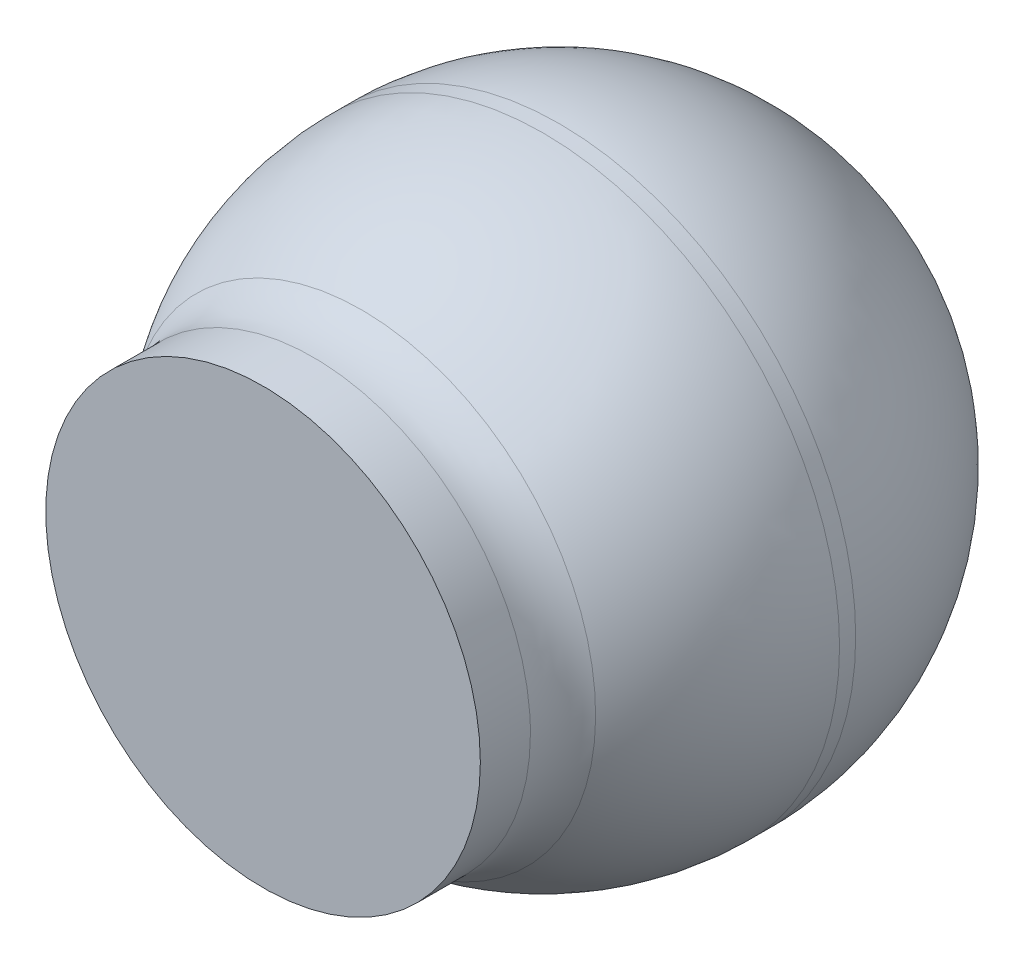
ISO-10303-21;
HEADER;
FILE_DESCRIPTION(('STEP AP214'),'2;1');
FILE_NAME('part.step','',(''),(''),'','','');
FILE_SCHEMA(('AUTOMOTIVE_DESIGN { 1 0 10303 214 1 1 1 1 }'));
ENDSEC;
DATA;
#1=APPLICATION_CONTEXT('core data for automotive mechanical design processes');
#2=APPLICATION_PROTOCOL_DEFINITION('international standard','automotive_design',2000,#1);
#3=PRODUCT_CONTEXT('',#1,'mechanical');
#4=PRODUCT('Part','Part','',(#3));
#5=PRODUCT_RELATED_PRODUCT_CATEGORY('part','',(#4));
#6=PRODUCT_DEFINITION_FORMATION('','',#4);
#7=PRODUCT_DEFINITION_CONTEXT('part definition',#1,'design');
#8=PRODUCT_DEFINITION('design','',#6,#7);
#9=PRODUCT_DEFINITION_SHAPE('','',#8);
#10=(LENGTH_UNIT() NAMED_UNIT(*) SI_UNIT(.MILLI.,.METRE.));
#11=(NAMED_UNIT(*) PLANE_ANGLE_UNIT() SI_UNIT($,.RADIAN.));
#12=(NAMED_UNIT(*) SI_UNIT($,.STERADIAN.) SOLID_ANGLE_UNIT());
#13=UNCERTAINTY_MEASURE_WITH_UNIT(LENGTH_MEASURE(1.E-05),#10,'distance_accuracy_value','');
#14=(GEOMETRIC_REPRESENTATION_CONTEXT(3) GLOBAL_UNCERTAINTY_ASSIGNED_CONTEXT((#13)) GLOBAL_UNIT_ASSIGNED_CONTEXT((#10,
#11,#12)) REPRESENTATION_CONTEXT('',''));
#15=CARTESIAN_POINT('',(0.,0.,0.));
#16=DIRECTION('',(0.,0.,1.));
#17=DIRECTION('',(1.,0.,0.));
#18=AXIS2_PLACEMENT_3D('',#15,#16,#17);
#19=CARTESIAN_POINT('',(-9.452919922269,-9.131349291452,10.006534503384));
#20=DIRECTION('',(0.,0.,-1.));
#21=DIRECTION('',(-1.,0.,0.));
#22=AXIS2_PLACEMENT_3D('',#19,#20,#21);
#23=PLANE('',#22);
#24=CARTESIAN_POINT('',(-9.452919922269,-9.131349291452,10.006534503384));
#25=DIRECTION('',(0.,0.,1.));
#26=DIRECTION('',(1.,0.,0.));
#27=AXIS2_PLACEMENT_3D('',#24,#25,#26);
#28=CIRCLE('',#27,0.275);
#29=CARTESIAN_POINT('',(-9.177919922269,-9.131349291452,10.006534503384));
#30=VERTEX_POINT('',#29);
#31=EDGE_CURVE('E20',#30,#30,#28,.F.);
#32=ORIENTED_EDGE('',*,*,#31,.F.);
#33=EDGE_LOOP('',(#32));
#34=FACE_BOUND('',#33,.T.);
#35=ADVANCED_FACE('F17',(#34),#23,.F.);
#36=CARTESIAN_POINT('',(-9.452919922269,-9.131349291452,9.906534503384));
#37=DIRECTION('',(0.,0.,1.));
#38=DIRECTION('',(1.,0.,0.));
#39=AXIS2_PLACEMENT_3D('',#36,#37,#38);
#40=CYLINDRICAL_SURFACE('',#39,0.275);
#41=CARTESIAN_POINT('',(-9.452919922269,-9.131349291452,9.943180457728));
#42=DIRECTION('',(0.,0.,-1.));
#43=DIRECTION('',(0.996700902337582,0.0811622527992467,0.));
#44=AXIS2_PLACEMENT_3D('',#41,#42,#43);
#45=CIRCLE('',#44,0.275000000000001);
#46=CARTESIAN_POINT('',(-9.17882717412617,-9.10902967193221,9.943180457728));
#47=VERTEX_POINT('',#46);
#48=EDGE_CURVE('E65',#47,#47,#45,.F.);
#49=ORIENTED_EDGE('',*,*,#48,.T.);
#50=EDGE_LOOP('',(#49));
#51=FACE_BOUND('',#50,.T.);
#52=ORIENTED_EDGE('',*,*,#31,.T.);
#53=EDGE_LOOP('',(#52));
#54=FACE_BOUND('',#53,.T.);
#55=ADVANCED_FACE('F62',(#51,#54),#40,.T.);
#56=CARTESIAN_POINT('',(-9.452919922269,-9.131349291452,9.943180457728));
#57=DIRECTION('',(0.,0.,-1.));
#58=DIRECTION('',(0.996700902337583,0.0811622527992448,0.));
#59=AXIS2_PLACEMENT_3D('',#56,#57,#58);
#60=TOROIDAL_SURFACE('',#59,0.375,0.1);
#61=ORIENTED_EDGE('',*,*,#48,.F.);
#62=EDGE_LOOP('',(#61));
#63=FACE_BOUND('',#62,.T.);
#64=CARTESIAN_POINT('',(-9.452919922269,-9.131349291452,9.881744931236));
#65=DIRECTION('',(0.,0.,-1.));
#66=DIRECTION('',(-0.996700902337597,-0.0811622527990627,0.));
#67=AXIS2_PLACEMENT_3D('',#64,#65,#66);
#68=CIRCLE('',#67,0.296097046412663);
#69=CARTESIAN_POINT('',(-9.748040115608,-9.155381194786,9.881744931236));
#70=VERTEX_POINT('',#69);
#71=EDGE_CURVE('E39',#70,#70,#68,.T.);
#72=ORIENTED_EDGE('',*,*,#71,.F.);
#73=EDGE_LOOP('',(#72));
#74=FACE_BOUND('',#73,.T.);
#75=ADVANCED_FACE('F57',(#63,#74),#60,.F.);
#76=CARTESIAN_POINT('',(-9.826682760645,-9.161785136252,9.651976062157));
#77=CARTESIAN_POINT('',(-9.826682760645,-9.161785136252,9.701461392103));
#78=CARTESIAN_POINT('',(-9.818526217348,-9.161120941579,9.750947004335));
#79=CARTESIAN_POINT('',(-9.802207085349,-9.159792059952,9.798626332798));
#80=CARTESIAN_POINT('',(-9.778341390838,-9.157848654938,9.842699544317));
#81=CARTESIAN_POINT('',(-9.748040115608,-9.155381194786,9.881744931236));
#82=(BOUNDED_CURVE() B_SPLINE_CURVE(5,(#76,#77,#78,#79,#80,#81),.UNSPECIFIED.,.F.,
.F.) B_SPLINE_CURVE_WITH_KNOTS((6,6),(0.,0.661568582165),
.UNSPECIFIED.) CURVE() GEOMETRIC_REPRESENTATION_ITEM() RATIONAL_B_SPLINE_CURVE((1.,1.,1.,1.,1.,1.)) REPRESENTATION_ITEM(''));
#83=CARTESIAN_POINT('',(-9.452919922269,-9.131349291452,9.651976062157));
#84=DIRECTION('',(0.,0.,-1.));
#85=AXIS1_PLACEMENT('',#83,#84);
#86=SURFACE_OF_REVOLUTION('',#82,#85);
#87=CARTESIAN_POINT('',(-9.452919922269,-9.131349291452,9.651976062157));
#88=DIRECTION('',(0.,0.,1.));
#89=DIRECTION('',(1.,0.,0.));
#90=AXIS2_PLACEMENT_3D('',#87,#88,#89);
#91=CIRCLE('',#90,0.375);
#92=CARTESIAN_POINT('',(-9.077919922269,-9.131349291452,9.651976062157));
#93=VERTEX_POINT('',#92);
#94=EDGE_CURVE('E36',#93,#93,#91,.F.);
#95=ORIENTED_EDGE('',*,*,#94,.F.);
#96=EDGE_LOOP('',(#95));
#97=FACE_BOUND('',#96,.T.);
#98=ORIENTED_EDGE('',*,*,#71,.T.);
#99=EDGE_LOOP('',(#98));
#100=FACE_BOUND('',#99,.T.);
#101=ADVANCED_FACE('F53',(#97,#100),#86,.F.);
#102=CARTESIAN_POINT('',(-9.452919922269,-9.131349291452,9.256534503384));
#103=DIRECTION('',(0.,0.,1.));
#104=DIRECTION('',(1.,0.,0.));
#105=AXIS2_PLACEMENT_3D('',#102,#103,#104);
#106=CYLINDRICAL_SURFACE('',#105,0.375);
#107=CARTESIAN_POINT('',(-9.452919922269,-9.131349291452,9.631534503384));
#108=DIRECTION('',(0.,0.,-1.));
#109=DIRECTION('',(0.0811622527992357,-0.996700902337583,0.));
#110=AXIS2_PLACEMENT_3D('',#107,#108,#109);
#111=CIRCLE('',#110,0.375);
#112=CARTESIAN_POINT('',(-9.42248407746929,-9.50511212982859,9.631534503384));
#113=VERTEX_POINT('',#112);
#114=CARTESIAN_POINT('',(-9.48335576706871,-8.75758645307541,9.631534503384));
#115=VERTEX_POINT('',#114);
#116=EDGE_CURVE('E11',#113,#115,#111,.T.);
#117=ORIENTED_EDGE('',*,*,#116,.F.);
#118=CARTESIAN_POINT('',(-9.452919922269,-9.131349291452,9.631534503384));
#119=DIRECTION('',(3.33436315446763E-12,2.72100352061447E-13,1.));
#120=DIRECTION('',(0.0811622527992365,-0.996700902337583,0.));
#121=AXIS2_PLACEMENT_3D('',#118,#119,#120);
#122=CIRCLE('',#121,0.375);
#123=EDGE_CURVE('E25',#115,#113,#122,.F.);
#124=ORIENTED_EDGE('',*,*,#123,.F.);
#125=EDGE_LOOP('',(#117,#124));
#126=FACE_BOUND('',#125,.T.);
#127=ORIENTED_EDGE('',*,*,#94,.T.);
#128=EDGE_LOOP('',(#127));
#129=FACE_BOUND('',#128,.T.);
#130=ADVANCED_FACE('F34',(#126,#129),#106,.T.);
#131=CARTESIAN_POINT('',(-9.452919922269,-9.131349291452,9.631534503384));
#132=DIRECTION('',(0.0811622527992361,-0.996700902337583,0.));
#133=DIRECTION('',(-0.996700902337583,-0.0811622527992361,0.));
#134=AXIS2_PLACEMENT_3D('',#131,#132,#133);
#135=SPHERICAL_SURFACE('',#134,0.375);
#136=ORIENTED_EDGE('',*,*,#123,.T.);
#137=ORIENTED_EDGE('',*,*,#116,.T.);
#138=EDGE_LOOP('',(#136,#137));
#139=FACE_BOUND('',#138,.T.);
#140=ADVANCED_FACE('F32',(#139),#135,.T.);
#141=CLOSED_SHELL('',(#35,#55,#75,#101,#130,#140));
#142=MANIFOLD_SOLID_BREP('B1',#141);
#143=ADVANCED_BREP_SHAPE_REPRESENTATION('',(#18,#142),#14);
#144=SHAPE_DEFINITION_REPRESENTATION(#9,#143);
ENDSEC;
END-ISO-10303-21;
